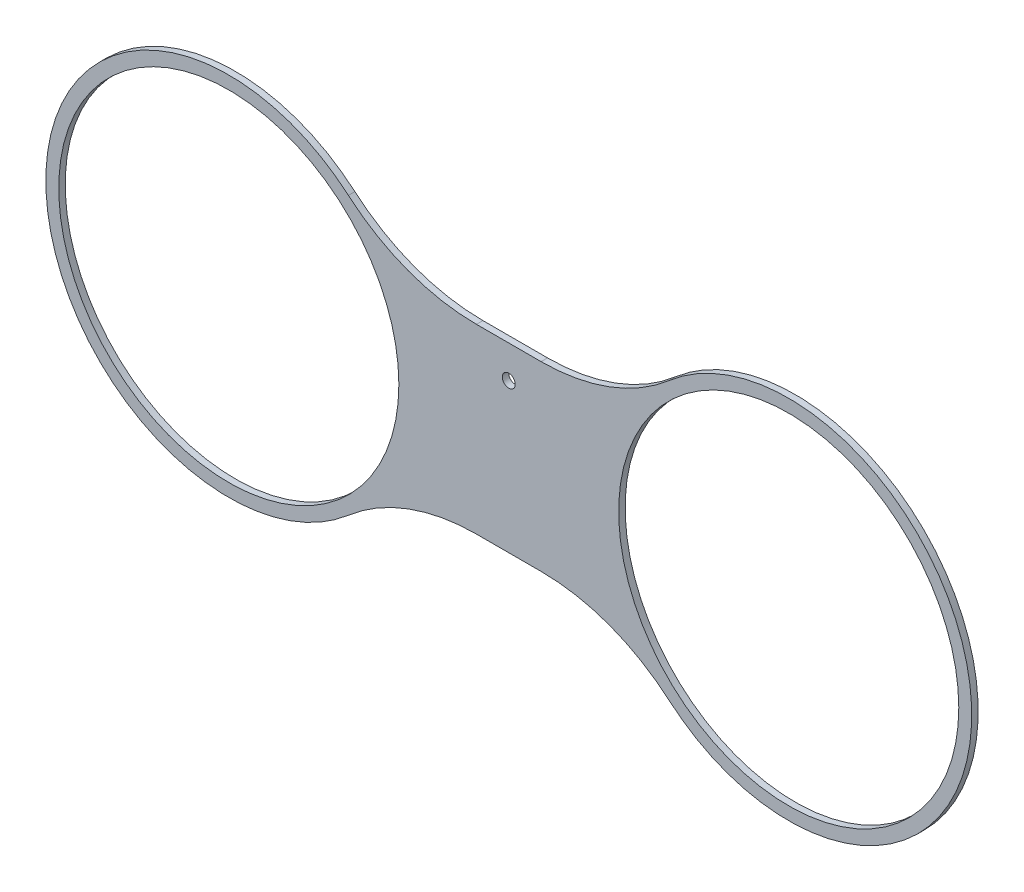
ISO-10303-21;
HEADER;
FILE_DESCRIPTION(('STEP AP214'),'2;1');
FILE_NAME('part.step','',(''),(''),'','','');
FILE_SCHEMA(('AUTOMOTIVE_DESIGN { 1 0 10303 214 1 1 1 1 }'));
ENDSEC;
DATA;
#1=APPLICATION_CONTEXT('core data for automotive mechanical design processes');
#2=APPLICATION_PROTOCOL_DEFINITION('international standard','automotive_design',2000,#1);
#3=PRODUCT_CONTEXT('',#1,'mechanical');
#4=PRODUCT('Part','Part','',(#3));
#5=PRODUCT_RELATED_PRODUCT_CATEGORY('part','',(#4));
#6=PRODUCT_DEFINITION_FORMATION('','',#4);
#7=PRODUCT_DEFINITION_CONTEXT('part definition',#1,'design');
#8=PRODUCT_DEFINITION('design','',#6,#7);
#9=PRODUCT_DEFINITION_SHAPE('','',#8);
#10=(LENGTH_UNIT() NAMED_UNIT(*) SI_UNIT(.MILLI.,.METRE.));
#11=(NAMED_UNIT(*) PLANE_ANGLE_UNIT() SI_UNIT($,.RADIAN.));
#12=(NAMED_UNIT(*) SI_UNIT($,.STERADIAN.) SOLID_ANGLE_UNIT());
#13=UNCERTAINTY_MEASURE_WITH_UNIT(LENGTH_MEASURE(1.E-05),#10,'distance_accuracy_value','');
#14=(GEOMETRIC_REPRESENTATION_CONTEXT(3) GLOBAL_UNCERTAINTY_ASSIGNED_CONTEXT((#13)) GLOBAL_UNIT_ASSIGNED_CONTEXT((#10,
#11,#12)) REPRESENTATION_CONTEXT('',''));
#15=CARTESIAN_POINT('',(0.,0.,0.));
#16=DIRECTION('',(0.,0.,1.));
#17=DIRECTION('',(1.,0.,0.));
#18=AXIS2_PLACEMENT_3D('',#15,#16,#17);
#19=CARTESIAN_POINT('',(15.8526007747364,-140.742861720744,3.175));
#20=DIRECTION('',(0.,0.,1.));
#21=DIRECTION('',(1.,0.,0.));
#22=AXIS2_PLACEMENT_3D('',#19,#20,#21);
#23=PLANE('',#22);
#24=CARTESIAN_POINT('',(-137.421087546886,-1.13862979215137E-13,3.175));
#25=DIRECTION('',(0.,0.,1.));
#26=DIRECTION('',(1.,0.,0.));
#27=AXIS2_PLACEMENT_3D('',#24,#25,#26);
#28=CIRCLE('',#27,83.4771);
#29=CARTESIAN_POINT('',(-53.9439875468861,-1.13862979215137E-13,3.175));
#30=VERTEX_POINT('',#29);
#31=EDGE_CURVE('E181',#30,#30,#28,.T.);
#32=ORIENTED_EDGE('',*,*,#31,.F.);
#33=EDGE_LOOP('',(#32));
#34=FACE_BOUND('',#33,.T.);
#35=CARTESIAN_POINT('',(15.8526007747364,-140.742861720744,3.175));
#36=DIRECTION('',(0.,0.,-1.));
#37=DIRECTION('',(1.,0.,0.));
#38=AXIS2_PLACEMENT_3D('',#35,#36,#37);
#39=CIRCLE('',#38,96.148519688983);
#40=CARTESIAN_POINT('',(15.8526007747364,-44.5943420317608,3.175));
#41=VERTEX_POINT('',#40);
#42=CARTESIAN_POINT('',(78.7018324643298,-67.9794649170584,3.175));
#43=VERTEX_POINT('',#42);
#44=EDGE_CURVE('E144',#41,#43,#39,.T.);
#45=ORIENTED_EDGE('',*,*,#44,.T.);
#46=CARTESIAN_POINT('',(137.418953,0.,3.175));
#47=DIRECTION('',(0.,0.,1.));
#48=DIRECTION('',(1.,0.,0.));
#49=AXIS2_PLACEMENT_3D('',#46,#47,#48);
#50=CIRCLE('',#49,89.8271);
#51=CARTESIAN_POINT('',(78.7018324643298,67.9794649170585,3.175));
#52=VERTEX_POINT('',#51);
#53=EDGE_CURVE('E92',#43,#52,#50,.T.);
#54=ORIENTED_EDGE('',*,*,#53,.T.);
#55=CARTESIAN_POINT('',(15.8526007747364,140.742861720744,3.175));
#56=DIRECTION('',(0.,0.,-1.));
#57=DIRECTION('',(-1.,0.,0.));
#58=AXIS2_PLACEMENT_3D('',#55,#56,#57);
#59=CIRCLE('',#58,96.148519688983);
#60=CARTESIAN_POINT('',(15.8526007747364,44.5943420317607,3.175));
#61=VERTEX_POINT('',#60);
#62=EDGE_CURVE('E159',#52,#61,#59,.T.);
#63=ORIENTED_EDGE('',*,*,#62,.T.);
#64=DIRECTION('',(-1.,0.,0.));
#65=VECTOR('',#64,1.);
#66=CARTESIAN_POINT('',(15.8526007747364,44.5943420317607,3.175));
#67=LINE('',#66,#65);
#68=CARTESIAN_POINT('',(-15.8547353216224,44.5943420317607,3.175));
#69=VERTEX_POINT('',#68);
#70=EDGE_CURVE('E172',#61,#69,#67,.T.);
#71=ORIENTED_EDGE('',*,*,#70,.T.);
#72=CARTESIAN_POINT('',(-15.8547353216224,140.742861720744,3.175));
#73=DIRECTION('',(0.,0.,-1.));
#74=DIRECTION('',(1.,0.,0.));
#75=AXIS2_PLACEMENT_3D('',#72,#73,#74);
#76=CIRCLE('',#75,96.148519688983);
#77=CARTESIAN_POINT('',(-78.7039670112159,67.9794649170585,3.175));
#78=VERTEX_POINT('',#77);
#79=EDGE_CURVE('E111',#69,#78,#76,.T.);
#80=ORIENTED_EDGE('',*,*,#79,.T.);
#81=CARTESIAN_POINT('',(-137.421087546886,-1.13862979215137E-13,3.175));
#82=DIRECTION('',(0.,0.,1.));
#83=DIRECTION('',(-1.,0.,0.));
#84=AXIS2_PLACEMENT_3D('',#81,#82,#83);
#85=CIRCLE('',#84,89.8271000000001);
#86=CARTESIAN_POINT('',(-78.7039670112158,-67.9794649170586,3.175));
#87=VERTEX_POINT('',#86);
#88=EDGE_CURVE('E105',#78,#87,#85,.T.);
#89=ORIENTED_EDGE('',*,*,#88,.T.);
#90=CARTESIAN_POINT('',(-15.8547353216225,-140.742861720744,3.175));
#91=DIRECTION('',(0.,0.,-1.));
#92=DIRECTION('',(-1.,0.,0.));
#93=AXIS2_PLACEMENT_3D('',#90,#91,#92);
#94=CIRCLE('',#93,96.148519688983);
#95=CARTESIAN_POINT('',(-15.8547353216225,-44.5943420317608,3.175));
#96=VERTEX_POINT('',#95);
#97=EDGE_CURVE('E109',#87,#96,#94,.T.);
#98=ORIENTED_EDGE('',*,*,#97,.T.);
#99=DIRECTION('',(1.,0.,0.));
#100=VECTOR('',#99,1.);
#101=CARTESIAN_POINT('',(-15.8547353216225,-44.5943420317608,3.175));
#102=LINE('',#101,#100);
#103=EDGE_CURVE('E49',#96,#41,#102,.T.);
#104=ORIENTED_EDGE('',*,*,#103,.T.);
#105=EDGE_LOOP('',(#45,#54,#63,#71,#80,#89,#98,#104));
#106=FACE_BOUND('',#105,.T.);
#107=CARTESIAN_POINT('',(137.418953,0.,3.175));
#108=DIRECTION('',(0.,0.,1.));
#109=DIRECTION('',(1.,0.,0.));
#110=AXIS2_PLACEMENT_3D('',#107,#108,#109);
#111=CIRCLE('',#110,83.4771);
#112=CARTESIAN_POINT('',(220.896053,0.,3.175));
#113=VERTEX_POINT('',#112);
#114=EDGE_CURVE('E133',#113,#113,#111,.T.);
#115=ORIENTED_EDGE('',*,*,#114,.F.);
#116=EDGE_LOOP('',(#115));
#117=FACE_BOUND('',#116,.T.);
#118=CARTESIAN_POINT('',(0.,28.575000035553,3.175));
#119=DIRECTION('',(0.,0.,1.));
#120=DIRECTION('',(1.,0.,0.));
#121=AXIS2_PLACEMENT_3D('',#118,#119,#120);
#122=CIRCLE('',#121,3.175);
#123=CARTESIAN_POINT('',(3.175,28.575000035553,3.175));
#124=VERTEX_POINT('',#123);
#125=EDGE_CURVE('E187',#124,#124,#122,.T.);
#126=ORIENTED_EDGE('',*,*,#125,.F.);
#127=EDGE_LOOP('',(#126));
#128=FACE_BOUND('',#127,.T.);
#129=ADVANCED_FACE('F32',(#34,#106,#117,#128),#23,.T.);
#130=CARTESIAN_POINT('',(15.8526007747364,-140.742861720744,0.));
#131=DIRECTION('',(0.,0.,1.));
#132=DIRECTION('',(1.,0.,0.));
#133=AXIS2_PLACEMENT_3D('',#130,#131,#132);
#134=PLANE('',#133);
#135=CARTESIAN_POINT('',(15.8526007747364,-140.742861720744,0.));
#136=DIRECTION('',(0.,0.,-1.));
#137=DIRECTION('',(1.,0.,0.));
#138=AXIS2_PLACEMENT_3D('',#135,#136,#137);
#139=CIRCLE('',#138,96.148519688983);
#140=CARTESIAN_POINT('',(15.8526007747364,-44.5943420317608,0.));
#141=VERTEX_POINT('',#140);
#142=CARTESIAN_POINT('',(78.7018324643298,-67.9794649170584,0.));
#143=VERTEX_POINT('',#142);
#144=EDGE_CURVE('E129',#141,#143,#139,.T.);
#145=ORIENTED_EDGE('',*,*,#144,.F.);
#146=DIRECTION('',(1.,0.,0.));
#147=VECTOR('',#146,1.);
#148=CARTESIAN_POINT('',(-15.8547353216225,-44.5943420317608,0.));
#149=LINE('',#148,#147);
#150=CARTESIAN_POINT('',(-15.8547353216225,-44.5943420317608,0.));
#151=VERTEX_POINT('',#150);
#152=EDGE_CURVE('E84',#151,#141,#149,.T.);
#153=ORIENTED_EDGE('',*,*,#152,.F.);
#154=CARTESIAN_POINT('',(-15.8547353216225,-140.742861720744,0.));
#155=DIRECTION('',(0.,0.,-1.));
#156=DIRECTION('',(-1.,0.,0.));
#157=AXIS2_PLACEMENT_3D('',#154,#155,#156);
#158=CIRCLE('',#157,96.148519688983);
#159=CARTESIAN_POINT('',(-78.7039670112158,-67.9794649170586,0.));
#160=VERTEX_POINT('',#159);
#161=EDGE_CURVE('E78',#160,#151,#158,.T.);
#162=ORIENTED_EDGE('',*,*,#161,.F.);
#163=CARTESIAN_POINT('',(-137.421087546886,-1.13862979215137E-13,0.));
#164=DIRECTION('',(0.,0.,1.));
#165=DIRECTION('',(-1.,0.,0.));
#166=AXIS2_PLACEMENT_3D('',#163,#164,#165);
#167=CIRCLE('',#166,89.8271000000001);
#168=CARTESIAN_POINT('',(-78.7039670112159,67.9794649170585,0.));
#169=VERTEX_POINT('',#168);
#170=EDGE_CURVE('E119',#169,#160,#167,.T.);
#171=ORIENTED_EDGE('',*,*,#170,.F.);
#172=CARTESIAN_POINT('',(-15.8547353216224,140.742861720744,0.));
#173=DIRECTION('',(0.,0.,-1.));
#174=DIRECTION('',(1.,0.,0.));
#175=AXIS2_PLACEMENT_3D('',#172,#173,#174);
#176=CIRCLE('',#175,96.148519688983);
#177=CARTESIAN_POINT('',(-15.8547353216224,44.5943420317607,0.));
#178=VERTEX_POINT('',#177);
#179=EDGE_CURVE('E139',#178,#169,#176,.T.);
#180=ORIENTED_EDGE('',*,*,#179,.F.);
#181=DIRECTION('',(-1.,0.,0.));
#182=VECTOR('',#181,1.);
#183=CARTESIAN_POINT('',(15.8526007747364,44.5943420317607,0.));
#184=LINE('',#183,#182);
#185=CARTESIAN_POINT('',(15.8526007747364,44.5943420317607,0.));
#186=VERTEX_POINT('',#185);
#187=EDGE_CURVE('E137',#186,#178,#184,.T.);
#188=ORIENTED_EDGE('',*,*,#187,.F.);
#189=CARTESIAN_POINT('',(15.8526007747364,140.742861720744,0.));
#190=DIRECTION('',(0.,0.,-1.));
#191=DIRECTION('',(-1.,0.,0.));
#192=AXIS2_PLACEMENT_3D('',#189,#190,#191);
#193=CIRCLE('',#192,96.148519688983);
#194=CARTESIAN_POINT('',(78.7018324643298,67.9794649170585,0.));
#195=VERTEX_POINT('',#194);
#196=EDGE_CURVE('E135',#195,#186,#193,.T.);
#197=ORIENTED_EDGE('',*,*,#196,.F.);
#198=CARTESIAN_POINT('',(137.418953,0.,0.));
#199=DIRECTION('',(0.,0.,1.));
#200=DIRECTION('',(1.,0.,0.));
#201=AXIS2_PLACEMENT_3D('',#198,#199,#200);
#202=CIRCLE('',#201,89.8271);
#203=EDGE_CURVE('E132',#143,#195,#202,.T.);
#204=ORIENTED_EDGE('',*,*,#203,.F.);
#205=EDGE_LOOP('',(#145,#153,#162,#171,#180,#188,#197,#204));
#206=FACE_BOUND('',#205,.T.);
#207=CARTESIAN_POINT('',(137.418953,0.,0.));
#208=DIRECTION('',(0.,0.,1.));
#209=DIRECTION('',(1.,0.,0.));
#210=AXIS2_PLACEMENT_3D('',#207,#208,#209);
#211=CIRCLE('',#210,83.4771);
#212=CARTESIAN_POINT('',(220.896053,0.,0.));
#213=VERTEX_POINT('',#212);
#214=EDGE_CURVE('E178',#213,#213,#211,.T.);
#215=ORIENTED_EDGE('',*,*,#214,.T.);
#216=EDGE_LOOP('',(#215));
#217=FACE_BOUND('',#216,.T.);
#218=CARTESIAN_POINT('',(-137.421087546886,-1.13862979215137E-13,0.));
#219=DIRECTION('',(0.,0.,1.));
#220=DIRECTION('',(1.,0.,0.));
#221=AXIS2_PLACEMENT_3D('',#218,#219,#220);
#222=CIRCLE('',#221,83.4771);
#223=CARTESIAN_POINT('',(-53.9439875468861,-1.13862979215137E-13,0.));
#224=VERTEX_POINT('',#223);
#225=EDGE_CURVE('E184',#224,#224,#222,.T.);
#226=ORIENTED_EDGE('',*,*,#225,.T.);
#227=EDGE_LOOP('',(#226));
#228=FACE_BOUND('',#227,.T.);
#229=CARTESIAN_POINT('',(0.,28.575000035553,0.));
#230=DIRECTION('',(0.,0.,1.));
#231=DIRECTION('',(1.,0.,0.));
#232=AXIS2_PLACEMENT_3D('',#229,#230,#231);
#233=CIRCLE('',#232,3.175);
#234=CARTESIAN_POINT('',(3.175,28.575000035553,0.));
#235=VERTEX_POINT('',#234);
#236=EDGE_CURVE('E190',#235,#235,#233,.T.);
#237=ORIENTED_EDGE('',*,*,#236,.T.);
#238=EDGE_LOOP('',(#237));
#239=FACE_BOUND('',#238,.T.);
#240=ADVANCED_FACE('F163',(#206,#217,#228,#239),#134,.F.);
#241=CARTESIAN_POINT('',(15.8526007747364,-140.742861720744,3.175));
#242=DIRECTION('',(0.,0.,-1.));
#243=DIRECTION('',(-1.,0.,0.));
#244=AXIS2_PLACEMENT_3D('',#241,#242,#243);
#245=CYLINDRICAL_SURFACE('',#244,96.148519688983);
#246=ORIENTED_EDGE('',*,*,#144,.T.);
#247=DIRECTION('',(0.,0.,-1.));
#248=VECTOR('',#247,1.);
#249=CARTESIAN_POINT('',(78.7018324643298,-67.9794649170584,3.175));
#250=LINE('',#249,#248);
#251=EDGE_CURVE('E11',#43,#143,#250,.T.);
#252=ORIENTED_EDGE('',*,*,#251,.F.);
#253=ORIENTED_EDGE('',*,*,#44,.F.);
#254=DIRECTION('',(0.,0.,-1.));
#255=VECTOR('',#254,1.);
#256=CARTESIAN_POINT('',(15.8526007747364,-44.5943420317608,3.175));
#257=LINE('',#256,#255);
#258=EDGE_CURVE('E125',#41,#141,#257,.T.);
#259=ORIENTED_EDGE('',*,*,#258,.T.);
#260=EDGE_LOOP('',(#246,#252,#253,#259));
#261=FACE_BOUND('',#260,.T.);
#262=ADVANCED_FACE('F34',(#261),#245,.F.);
#263=CARTESIAN_POINT('',(137.418953,0.,3.175));
#264=DIRECTION('',(0.,0.,-1.));
#265=DIRECTION('',(-1.,0.,0.));
#266=AXIS2_PLACEMENT_3D('',#263,#264,#265);
#267=CYLINDRICAL_SURFACE('',#266,89.8271);
#268=ORIENTED_EDGE('',*,*,#203,.T.);
#269=DIRECTION('',(0.,0.,-1.));
#270=VECTOR('',#269,1.);
#271=CARTESIAN_POINT('',(78.7018324643298,67.9794649170585,3.175));
#272=LINE('',#271,#270);
#273=EDGE_CURVE('E41',#52,#195,#272,.T.);
#274=ORIENTED_EDGE('',*,*,#273,.F.);
#275=ORIENTED_EDGE('',*,*,#53,.F.);
#276=ORIENTED_EDGE('',*,*,#251,.T.);
#277=EDGE_LOOP('',(#268,#274,#275,#276));
#278=FACE_BOUND('',#277,.T.);
#279=ADVANCED_FACE('F223',(#278),#267,.T.);
#280=CARTESIAN_POINT('',(15.8526007747364,140.742861720744,3.175));
#281=DIRECTION('',(0.,0.,-1.));
#282=DIRECTION('',(-1.,0.,0.));
#283=AXIS2_PLACEMENT_3D('',#280,#281,#282);
#284=CYLINDRICAL_SURFACE('',#283,96.148519688983);
#285=ORIENTED_EDGE('',*,*,#196,.T.);
#286=DIRECTION('',(0.,0.,-1.));
#287=VECTOR('',#286,1.);
#288=CARTESIAN_POINT('',(15.8526007747364,44.5943420317607,3.175));
#289=LINE('',#288,#287);
#290=EDGE_CURVE('E151',#61,#186,#289,.T.);
#291=ORIENTED_EDGE('',*,*,#290,.F.);
#292=ORIENTED_EDGE('',*,*,#62,.F.);
#293=ORIENTED_EDGE('',*,*,#273,.T.);
#294=EDGE_LOOP('',(#285,#291,#292,#293));
#295=FACE_BOUND('',#294,.T.);
#296=ADVANCED_FACE('F157',(#295),#284,.F.);
#297=CARTESIAN_POINT('',(15.8526007747364,44.5943420317607,3.175));
#298=DIRECTION('',(0.,-1.,0.));
#299=DIRECTION('',(0.,0.,-1.));
#300=AXIS2_PLACEMENT_3D('',#297,#298,#299);
#301=PLANE('',#300);
#302=ORIENTED_EDGE('',*,*,#187,.T.);
#303=DIRECTION('',(0.,0.,-1.));
#304=VECTOR('',#303,1.);
#305=CARTESIAN_POINT('',(-15.8547353216224,44.5943420317607,3.175));
#306=LINE('',#305,#304);
#307=EDGE_CURVE('E148',#69,#178,#306,.T.);
#308=ORIENTED_EDGE('',*,*,#307,.F.);
#309=ORIENTED_EDGE('',*,*,#70,.F.);
#310=ORIENTED_EDGE('',*,*,#290,.T.);
#311=EDGE_LOOP('',(#302,#308,#309,#310));
#312=FACE_BOUND('',#311,.T.);
#313=ADVANCED_FACE('F168',(#312),#301,.F.);
#314=CARTESIAN_POINT('',(-15.8547353216224,140.742861720744,3.175));
#315=DIRECTION('',(0.,0.,-1.));
#316=DIRECTION('',(-1.,0.,0.));
#317=AXIS2_PLACEMENT_3D('',#314,#315,#316);
#318=CYLINDRICAL_SURFACE('',#317,96.148519688983);
#319=ORIENTED_EDGE('',*,*,#179,.T.);
#320=DIRECTION('',(0.,0.,-1.));
#321=VECTOR('',#320,1.);
#322=CARTESIAN_POINT('',(-78.7039670112159,67.9794649170585,3.175));
#323=LINE('',#322,#321);
#324=EDGE_CURVE('E120',#78,#169,#323,.T.);
#325=ORIENTED_EDGE('',*,*,#324,.F.);
#326=ORIENTED_EDGE('',*,*,#79,.F.);
#327=ORIENTED_EDGE('',*,*,#307,.T.);
#328=EDGE_LOOP('',(#319,#325,#326,#327));
#329=FACE_BOUND('',#328,.T.);
#330=ADVANCED_FACE('F171',(#329),#318,.F.);
#331=CARTESIAN_POINT('',(-137.421087546886,-1.13862979215137E-13,3.175));
#332=DIRECTION('',(0.,0.,-1.));
#333=DIRECTION('',(-1.,0.,0.));
#334=AXIS2_PLACEMENT_3D('',#331,#332,#333);
#335=CYLINDRICAL_SURFACE('',#334,89.8271000000001);
#336=ORIENTED_EDGE('',*,*,#170,.T.);
#337=DIRECTION('',(0.,0.,-1.));
#338=VECTOR('',#337,1.);
#339=CARTESIAN_POINT('',(-78.7039670112158,-67.9794649170586,3.175));
#340=LINE('',#339,#338);
#341=EDGE_CURVE('E116',#87,#160,#340,.T.);
#342=ORIENTED_EDGE('',*,*,#341,.F.);
#343=ORIENTED_EDGE('',*,*,#88,.F.);
#344=ORIENTED_EDGE('',*,*,#324,.T.);
#345=EDGE_LOOP('',(#336,#342,#343,#344));
#346=FACE_BOUND('',#345,.T.);
#347=ADVANCED_FACE('F117',(#346),#335,.T.);
#348=CARTESIAN_POINT('',(-15.8547353216225,-140.742861720744,3.175));
#349=DIRECTION('',(0.,0.,-1.));
#350=DIRECTION('',(-1.,0.,0.));
#351=AXIS2_PLACEMENT_3D('',#348,#349,#350);
#352=CYLINDRICAL_SURFACE('',#351,96.148519688983);
#353=ORIENTED_EDGE('',*,*,#161,.T.);
#354=DIRECTION('',(0.,0.,-1.));
#355=VECTOR('',#354,1.);
#356=CARTESIAN_POINT('',(-15.8547353216225,-44.5943420317608,3.175));
#357=LINE('',#356,#355);
#358=EDGE_CURVE('E121',#96,#151,#357,.T.);
#359=ORIENTED_EDGE('',*,*,#358,.F.);
#360=ORIENTED_EDGE('',*,*,#97,.F.);
#361=ORIENTED_EDGE('',*,*,#341,.T.);
#362=EDGE_LOOP('',(#353,#359,#360,#361));
#363=FACE_BOUND('',#362,.T.);
#364=ADVANCED_FACE('F123',(#363),#352,.F.);
#365=CARTESIAN_POINT('',(-15.8547353216225,-44.5943420317608,3.175));
#366=DIRECTION('',(0.,1.,0.));
#367=DIRECTION('',(0.,0.,1.));
#368=AXIS2_PLACEMENT_3D('',#365,#366,#367);
#369=PLANE('',#368);
#370=ORIENTED_EDGE('',*,*,#152,.T.);
#371=ORIENTED_EDGE('',*,*,#258,.F.);
#372=ORIENTED_EDGE('',*,*,#103,.F.);
#373=ORIENTED_EDGE('',*,*,#358,.T.);
#374=EDGE_LOOP('',(#370,#371,#372,#373));
#375=FACE_BOUND('',#374,.T.);
#376=ADVANCED_FACE('F211',(#375),#369,.F.);
#377=CARTESIAN_POINT('',(137.418953,0.,3.175));
#378=DIRECTION('',(0.,0.,-1.));
#379=DIRECTION('',(-1.,0.,0.));
#380=AXIS2_PLACEMENT_3D('',#377,#378,#379);
#381=CYLINDRICAL_SURFACE('',#380,83.4771);
#382=ORIENTED_EDGE('',*,*,#114,.T.);
#383=EDGE_LOOP('',(#382));
#384=FACE_BOUND('',#383,.T.);
#385=ORIENTED_EDGE('',*,*,#214,.F.);
#386=EDGE_LOOP('',(#385));
#387=FACE_BOUND('',#386,.T.);
#388=ADVANCED_FACE('F208',(#384,#387),#381,.F.);
#389=CARTESIAN_POINT('',(-137.421087546886,-1.13862979215137E-13,3.175));
#390=DIRECTION('',(0.,0.,-1.));
#391=DIRECTION('',(-1.,0.,0.));
#392=AXIS2_PLACEMENT_3D('',#389,#390,#391);
#393=CYLINDRICAL_SURFACE('',#392,83.4771);
#394=ORIENTED_EDGE('',*,*,#31,.T.);
#395=EDGE_LOOP('',(#394));
#396=FACE_BOUND('',#395,.T.);
#397=ORIENTED_EDGE('',*,*,#225,.F.);
#398=EDGE_LOOP('',(#397));
#399=FACE_BOUND('',#398,.T.);
#400=ADVANCED_FACE('F287',(#396,#399),#393,.F.);
#401=CARTESIAN_POINT('',(0.,28.575000035553,3.175));
#402=DIRECTION('',(0.,0.,-1.));
#403=DIRECTION('',(-1.,0.,0.));
#404=AXIS2_PLACEMENT_3D('',#401,#402,#403);
#405=CYLINDRICAL_SURFACE('',#404,3.175);
#406=ORIENTED_EDGE('',*,*,#125,.T.);
#407=EDGE_LOOP('',(#406));
#408=FACE_BOUND('',#407,.T.);
#409=ORIENTED_EDGE('',*,*,#236,.F.);
#410=EDGE_LOOP('',(#409));
#411=FACE_BOUND('',#410,.T.);
#412=ADVANCED_FACE('F196',(#408,#411),#405,.F.);
#413=CLOSED_SHELL('',(#129,#240,#262,#279,#296,#313,#330,#347,#364,#376,#388,#400,#412));
#414=MANIFOLD_SOLID_BREP('B2',#413);
#415=ADVANCED_BREP_SHAPE_REPRESENTATION('',(#18,#414),#14);
#416=SHAPE_DEFINITION_REPRESENTATION(#9,#415);
ENDSEC;
END-ISO-10303-21;
